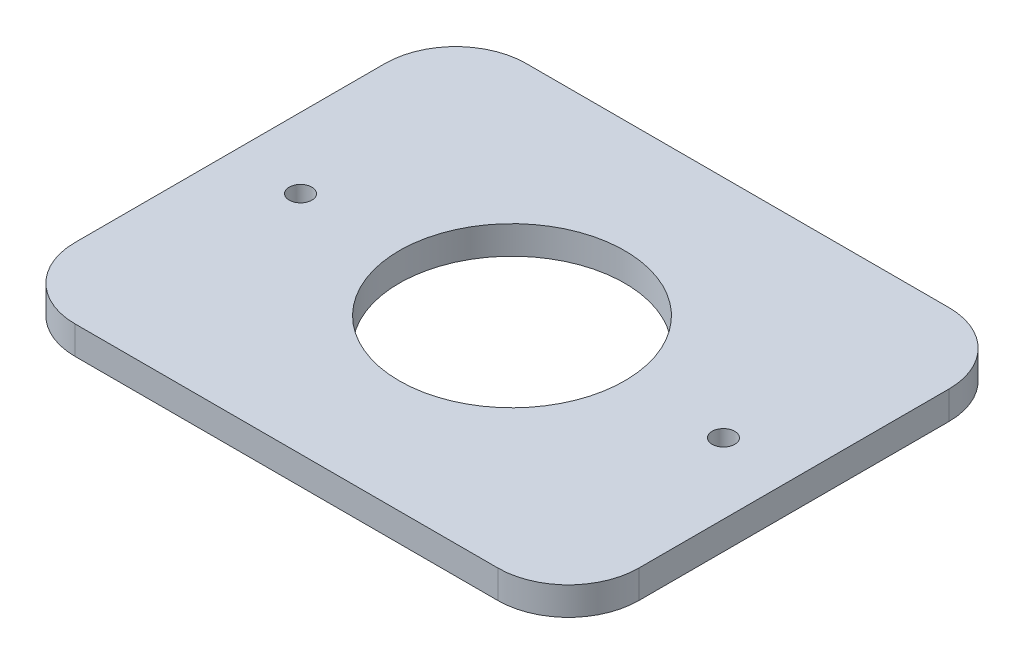
ISO-10303-21;
HEADER;
FILE_DESCRIPTION(('STEP AP214'),'2;1');
FILE_NAME('part.step','',(''),(''),'','','');
FILE_SCHEMA(('AUTOMOTIVE_DESIGN { 1 0 10303 214 1 1 1 1 }'));
ENDSEC;
DATA;
#1=APPLICATION_CONTEXT('core data for automotive mechanical design processes');
#2=APPLICATION_PROTOCOL_DEFINITION('international standard','automotive_design',2000,#1);
#3=PRODUCT_CONTEXT('',#1,'mechanical');
#4=PRODUCT('Part','Part','',(#3));
#5=PRODUCT_RELATED_PRODUCT_CATEGORY('part','',(#4));
#6=PRODUCT_DEFINITION_FORMATION('','',#4);
#7=PRODUCT_DEFINITION_CONTEXT('part definition',#1,'design');
#8=PRODUCT_DEFINITION('design','',#6,#7);
#9=PRODUCT_DEFINITION_SHAPE('','',#8);
#10=(LENGTH_UNIT() NAMED_UNIT(*) SI_UNIT(.MILLI.,.METRE.));
#11=(NAMED_UNIT(*) PLANE_ANGLE_UNIT() SI_UNIT($,.RADIAN.));
#12=(NAMED_UNIT(*) SI_UNIT($,.STERADIAN.) SOLID_ANGLE_UNIT());
#13=UNCERTAINTY_MEASURE_WITH_UNIT(LENGTH_MEASURE(1.E-05),#10,'distance_accuracy_value','');
#14=(GEOMETRIC_REPRESENTATION_CONTEXT(3) GLOBAL_UNCERTAINTY_ASSIGNED_CONTEXT((#13)) GLOBAL_UNIT_ASSIGNED_CONTEXT((#10,
#11,#12)) REPRESENTATION_CONTEXT('',''));
#15=CARTESIAN_POINT('',(0.,0.,0.));
#16=DIRECTION('',(0.,0.,1.));
#17=DIRECTION('',(1.,0.,0.));
#18=AXIS2_PLACEMENT_3D('',#15,#16,#17);
#19=CARTESIAN_POINT('',(0.,0.,0.));
#20=DIRECTION('',(0.,1.,0.));
#21=DIRECTION('',(0.,0.,1.));
#22=AXIS2_PLACEMENT_3D('',#19,#20,#21);
#23=PLANE('',#22);
#24=CARTESIAN_POINT('',(-15.,0.,0.));
#25=DIRECTION('',(0.,1.,0.));
#26=DIRECTION('',(0.,0.,1.));
#27=AXIS2_PLACEMENT_3D('',#24,#25,#26);
#28=CIRCLE('',#27,0.803797355944);
#29=CARTESIAN_POINT('',(-15.,0.,0.803797355944));
#30=VERTEX_POINT('',#29);
#31=EDGE_CURVE('E136',#30,#30,#28,.T.);
#32=ORIENTED_EDGE('',*,*,#31,.T.);
#33=EDGE_LOOP('',(#32));
#34=FACE_BOUND('',#33,.T.);
#35=CARTESIAN_POINT('',(15.,0.,0.));
#36=DIRECTION('',(0.,1.,0.));
#37=DIRECTION('',(0.,0.,1.));
#38=AXIS2_PLACEMENT_3D('',#35,#36,#37);
#39=CIRCLE('',#38,0.803797355944);
#40=CARTESIAN_POINT('',(15.,0.,0.803797355944));
#41=VERTEX_POINT('',#40);
#42=EDGE_CURVE('E139',#41,#41,#39,.T.);
#43=ORIENTED_EDGE('',*,*,#42,.T.);
#44=EDGE_LOOP('',(#43));
#45=FACE_BOUND('',#44,.T.);
#46=CARTESIAN_POINT('',(0.,0.,0.));
#47=DIRECTION('',(0.,1.,0.));
#48=DIRECTION('',(0.,0.,1.));
#49=AXIS2_PLACEMENT_3D('',#46,#47,#48);
#50=CIRCLE('',#49,8.);
#51=CARTESIAN_POINT('',(0.,0.,8.));
#52=VERTEX_POINT('',#51);
#53=EDGE_CURVE('E142',#52,#52,#50,.T.);
#54=ORIENTED_EDGE('',*,*,#53,.T.);
#55=EDGE_LOOP('',(#54));
#56=FACE_BOUND('',#55,.T.);
#57=CARTESIAN_POINT('',(-15.,0.,11.));
#58=DIRECTION('',(0.,-1.,0.));
#59=DIRECTION('',(0.,0.,-1.));
#60=AXIS2_PLACEMENT_3D('',#57,#58,#59);
#61=CIRCLE('',#60,5.);
#62=CARTESIAN_POINT('',(-20.,0.,11.));
#63=VERTEX_POINT('',#62);
#64=CARTESIAN_POINT('',(-15.,0.,16.));
#65=VERTEX_POINT('',#64);
#66=EDGE_CURVE('E148',#63,#65,#61,.F.);
#67=ORIENTED_EDGE('',*,*,#66,.F.);
#68=DIRECTION('',(0.,0.,1.));
#69=VECTOR('',#68,1.);
#70=CARTESIAN_POINT('',(-20.,0.,-16.));
#71=LINE('',#70,#69);
#72=CARTESIAN_POINT('',(-20.,0.,-11.));
#73=VERTEX_POINT('',#72);
#74=EDGE_CURVE('E114',#73,#63,#71,.T.);
#75=ORIENTED_EDGE('',*,*,#74,.F.);
#76=CARTESIAN_POINT('',(-15.,0.,-11.));
#77=DIRECTION('',(0.,-1.,0.));
#78=DIRECTION('',(0.,0.,-1.));
#79=AXIS2_PLACEMENT_3D('',#76,#77,#78);
#80=CIRCLE('',#79,5.);
#81=CARTESIAN_POINT('',(-15.,0.,-16.));
#82=VERTEX_POINT('',#81);
#83=EDGE_CURVE('E88',#82,#73,#80,.F.);
#84=ORIENTED_EDGE('',*,*,#83,.F.);
#85=DIRECTION('',(-1.,0.,0.));
#86=VECTOR('',#85,1.);
#87=CARTESIAN_POINT('',(20.,0.,-16.));
#88=LINE('',#87,#86);
#89=CARTESIAN_POINT('',(15.,0.,-16.));
#90=VERTEX_POINT('',#89);
#91=EDGE_CURVE('E83',#90,#82,#88,.T.);
#92=ORIENTED_EDGE('',*,*,#91,.F.);
#93=CARTESIAN_POINT('',(15.,0.,-11.));
#94=DIRECTION('',(0.,-1.,0.));
#95=DIRECTION('',(0.,0.,-1.));
#96=AXIS2_PLACEMENT_3D('',#93,#94,#95);
#97=CIRCLE('',#96,5.);
#98=CARTESIAN_POINT('',(20.,0.,-11.));
#99=VERTEX_POINT('',#98);
#100=EDGE_CURVE('E20',#99,#90,#97,.F.);
#101=ORIENTED_EDGE('',*,*,#100,.F.);
#102=DIRECTION('',(0.,0.,-1.));
#103=VECTOR('',#102,1.);
#104=CARTESIAN_POINT('',(20.,0.,16.));
#105=LINE('',#104,#103);
#106=CARTESIAN_POINT('',(20.,0.,11.));
#107=VERTEX_POINT('',#106);
#108=EDGE_CURVE('E78',#107,#99,#105,.T.);
#109=ORIENTED_EDGE('',*,*,#108,.F.);
#110=CARTESIAN_POINT('',(15.,0.,11.));
#111=DIRECTION('',(0.,-1.,0.));
#112=DIRECTION('',(0.,0.,-1.));
#113=AXIS2_PLACEMENT_3D('',#110,#111,#112);
#114=CIRCLE('',#113,5.);
#115=CARTESIAN_POINT('',(15.,0.,16.));
#116=VERTEX_POINT('',#115);
#117=EDGE_CURVE('E145',#116,#107,#114,.F.);
#118=ORIENTED_EDGE('',*,*,#117,.F.);
#119=DIRECTION('',(1.,0.,0.));
#120=VECTOR('',#119,1.);
#121=CARTESIAN_POINT('',(-20.,0.,16.));
#122=LINE('',#121,#120);
#123=EDGE_CURVE('E109',#65,#116,#122,.T.);
#124=ORIENTED_EDGE('',*,*,#123,.F.);
#125=EDGE_LOOP('',(#67,#75,#84,#92,#101,#109,#118,#124));
#126=FACE_BOUND('',#125,.T.);
#127=ADVANCED_FACE('F17',(#34,#45,#56,#126),#23,.F.);
#128=CARTESIAN_POINT('',(20.,0.,16.));
#129=DIRECTION('',(1.,0.,0.));
#130=DIRECTION('',(0.,0.,-1.));
#131=AXIS2_PLACEMENT_3D('',#128,#129,#130);
#132=PLANE('',#131);
#133=DIRECTION('',(0.,0.,1.));
#134=VECTOR('',#133,1.);
#135=CARTESIAN_POINT('',(20.,2.,0.));
#136=LINE('',#135,#134);
#137=CARTESIAN_POINT('',(20.,2.,11.));
#138=VERTEX_POINT('',#137);
#139=CARTESIAN_POINT('',(20.,2.,-11.));
#140=VERTEX_POINT('',#139);
#141=EDGE_CURVE('E135',#138,#140,#136,.F.);
#142=ORIENTED_EDGE('',*,*,#141,.F.);
#143=DIRECTION('',(0.,-1.,0.));
#144=VECTOR('',#143,1.);
#145=CARTESIAN_POINT('',(20.,2.015648,11.));
#146=LINE('',#145,#144);
#147=EDGE_CURVE('E111',#107,#138,#146,.F.);
#148=ORIENTED_EDGE('',*,*,#147,.F.);
#149=ORIENTED_EDGE('',*,*,#108,.T.);
#150=DIRECTION('',(0.,-1.,0.));
#151=VECTOR('',#150,1.);
#152=CARTESIAN_POINT('',(20.,2.015648,-11.));
#153=LINE('',#152,#151);
#154=EDGE_CURVE('E98',#140,#99,#153,.T.);
#155=ORIENTED_EDGE('',*,*,#154,.F.);
#156=EDGE_LOOP('',(#142,#148,#149,#155));
#157=FACE_BOUND('',#156,.T.);
#158=ADVANCED_FACE('F181',(#157),#132,.T.);
#159=CARTESIAN_POINT('',(15.,2.015648,-11.));
#160=DIRECTION('',(0.,-1.,0.));
#161=DIRECTION('',(0.,0.,-1.));
#162=AXIS2_PLACEMENT_3D('',#159,#160,#161);
#163=CYLINDRICAL_SURFACE('',#162,5.);
#164=ORIENTED_EDGE('',*,*,#154,.T.);
#165=ORIENTED_EDGE('',*,*,#100,.T.);
#166=DIRECTION('',(0.,1.,0.));
#167=VECTOR('',#166,1.);
#168=CARTESIAN_POINT('',(15.,0.,-16.));
#169=LINE('',#168,#167);
#170=CARTESIAN_POINT('',(15.,2.,-16.));
#171=VERTEX_POINT('',#170);
#172=EDGE_CURVE('E92',#171,#90,#169,.F.);
#173=ORIENTED_EDGE('',*,*,#172,.F.);
#174=CARTESIAN_POINT('',(15.,2.,-11.));
#175=DIRECTION('',(0.,-1.,0.));
#176=DIRECTION('',(0.,0.,-1.));
#177=AXIS2_PLACEMENT_3D('',#174,#175,#176);
#178=CIRCLE('',#177,5.);
#179=EDGE_CURVE('E133',#140,#171,#178,.F.);
#180=ORIENTED_EDGE('',*,*,#179,.F.);
#181=EDGE_LOOP('',(#164,#165,#173,#180));
#182=FACE_BOUND('',#181,.T.);
#183=ADVANCED_FACE('F95',(#182),#163,.T.);
#184=CARTESIAN_POINT('',(20.,0.,-16.));
#185=DIRECTION('',(0.,0.,-1.));
#186=DIRECTION('',(-1.,0.,0.));
#187=AXIS2_PLACEMENT_3D('',#184,#185,#186);
#188=PLANE('',#187);
#189=DIRECTION('',(1.,0.,0.));
#190=VECTOR('',#189,1.);
#191=CARTESIAN_POINT('',(0.,2.,-16.));
#192=LINE('',#191,#190);
#193=CARTESIAN_POINT('',(-15.,2.,-16.));
#194=VERTEX_POINT('',#193);
#195=EDGE_CURVE('E101',#171,#194,#192,.F.);
#196=ORIENTED_EDGE('',*,*,#195,.F.);
#197=ORIENTED_EDGE('',*,*,#172,.T.);
#198=ORIENTED_EDGE('',*,*,#91,.T.);
#199=DIRECTION('',(0.,-1.,0.));
#200=VECTOR('',#199,1.);
#201=CARTESIAN_POINT('',(-15.,2.015648,-16.));
#202=LINE('',#201,#200);
#203=EDGE_CURVE('E103',#194,#82,#202,.T.);
#204=ORIENTED_EDGE('',*,*,#203,.F.);
#205=EDGE_LOOP('',(#196,#197,#198,#204));
#206=FACE_BOUND('',#205,.T.);
#207=ADVANCED_FACE('F99',(#206),#188,.T.);
#208=CARTESIAN_POINT('',(-15.,2.015648,-11.));
#209=DIRECTION('',(0.,-1.,0.));
#210=DIRECTION('',(0.,0.,-1.));
#211=AXIS2_PLACEMENT_3D('',#208,#209,#210);
#212=CYLINDRICAL_SURFACE('',#211,5.);
#213=ORIENTED_EDGE('',*,*,#203,.T.);
#214=ORIENTED_EDGE('',*,*,#83,.T.);
#215=DIRECTION('',(0.,1.,0.));
#216=VECTOR('',#215,1.);
#217=CARTESIAN_POINT('',(-20.,0.,-11.));
#218=LINE('',#217,#216);
#219=CARTESIAN_POINT('',(-20.,2.,-11.));
#220=VERTEX_POINT('',#219);
#221=EDGE_CURVE('E115',#220,#73,#218,.F.);
#222=ORIENTED_EDGE('',*,*,#221,.F.);
#223=CARTESIAN_POINT('',(-15.,2.,-11.));
#224=DIRECTION('',(0.,-1.,0.));
#225=DIRECTION('',(0.,0.,-1.));
#226=AXIS2_PLACEMENT_3D('',#223,#224,#225);
#227=CIRCLE('',#226,5.);
#228=EDGE_CURVE('E130',#194,#220,#227,.F.);
#229=ORIENTED_EDGE('',*,*,#228,.F.);
#230=EDGE_LOOP('',(#213,#214,#222,#229));
#231=FACE_BOUND('',#230,.T.);
#232=ADVANCED_FACE('F152',(#231),#212,.T.);
#233=CARTESIAN_POINT('',(-20.,0.,-16.));
#234=DIRECTION('',(-1.,0.,0.));
#235=DIRECTION('',(0.,0.,1.));
#236=AXIS2_PLACEMENT_3D('',#233,#234,#235);
#237=PLANE('',#236);
#238=DIRECTION('',(0.,0.,1.));
#239=VECTOR('',#238,1.);
#240=CARTESIAN_POINT('',(-20.,2.,0.));
#241=LINE('',#240,#239);
#242=CARTESIAN_POINT('',(-20.,2.,11.));
#243=VERTEX_POINT('',#242);
#244=EDGE_CURVE('E129',#220,#243,#241,.T.);
#245=ORIENTED_EDGE('',*,*,#244,.F.);
#246=ORIENTED_EDGE('',*,*,#221,.T.);
#247=ORIENTED_EDGE('',*,*,#74,.T.);
#248=DIRECTION('',(0.,-1.,0.));
#249=VECTOR('',#248,1.);
#250=CARTESIAN_POINT('',(-20.,2.015648,11.));
#251=LINE('',#250,#249);
#252=EDGE_CURVE('E149',#243,#63,#251,.T.);
#253=ORIENTED_EDGE('',*,*,#252,.F.);
#254=EDGE_LOOP('',(#245,#246,#247,#253));
#255=FACE_BOUND('',#254,.T.);
#256=ADVANCED_FACE('F156',(#255),#237,.T.);
#257=CARTESIAN_POINT('',(-15.,2.015648,11.));
#258=DIRECTION('',(0.,-1.,0.));
#259=DIRECTION('',(0.,0.,-1.));
#260=AXIS2_PLACEMENT_3D('',#257,#258,#259);
#261=CYLINDRICAL_SURFACE('',#260,5.);
#262=ORIENTED_EDGE('',*,*,#252,.T.);
#263=ORIENTED_EDGE('',*,*,#66,.T.);
#264=DIRECTION('',(0.,1.,0.));
#265=VECTOR('',#264,1.);
#266=CARTESIAN_POINT('',(-15.,0.,16.));
#267=LINE('',#266,#265);
#268=CARTESIAN_POINT('',(-15.,2.,16.));
#269=VERTEX_POINT('',#268);
#270=EDGE_CURVE('E112',#269,#65,#267,.F.);
#271=ORIENTED_EDGE('',*,*,#270,.F.);
#272=CARTESIAN_POINT('',(-15.,2.,11.));
#273=DIRECTION('',(0.,-1.,0.));
#274=DIRECTION('',(0.,0.,-1.));
#275=AXIS2_PLACEMENT_3D('',#272,#273,#274);
#276=CIRCLE('',#275,5.);
#277=EDGE_CURVE('E126',#243,#269,#276,.F.);
#278=ORIENTED_EDGE('',*,*,#277,.F.);
#279=EDGE_LOOP('',(#262,#263,#271,#278));
#280=FACE_BOUND('',#279,.T.);
#281=ADVANCED_FACE('F178',(#280),#261,.T.);
#282=CARTESIAN_POINT('',(-20.,0.,16.));
#283=DIRECTION('',(0.,0.,1.));
#284=DIRECTION('',(1.,0.,0.));
#285=AXIS2_PLACEMENT_3D('',#282,#283,#284);
#286=PLANE('',#285);
#287=ORIENTED_EDGE('',*,*,#123,.T.);
#288=DIRECTION('',(0.,-1.,0.));
#289=VECTOR('',#288,1.);
#290=CARTESIAN_POINT('',(15.,2.015648,16.));
#291=LINE('',#290,#289);
#292=CARTESIAN_POINT('',(15.,2.,16.));
#293=VERTEX_POINT('',#292);
#294=EDGE_CURVE('E35',#293,#116,#291,.T.);
#295=ORIENTED_EDGE('',*,*,#294,.F.);
#296=DIRECTION('',(1.,0.,0.));
#297=VECTOR('',#296,1.);
#298=CARTESIAN_POINT('',(0.,2.,16.));
#299=LINE('',#298,#297);
#300=EDGE_CURVE('E125',#269,#293,#299,.T.);
#301=ORIENTED_EDGE('',*,*,#300,.F.);
#302=ORIENTED_EDGE('',*,*,#270,.T.);
#303=EDGE_LOOP('',(#287,#295,#301,#302));
#304=FACE_BOUND('',#303,.T.);
#305=ADVANCED_FACE('F174',(#304),#286,.T.);
#306=CARTESIAN_POINT('',(15.,2.015648,11.));
#307=DIRECTION('',(0.,-1.,0.));
#308=DIRECTION('',(0.,0.,-1.));
#309=AXIS2_PLACEMENT_3D('',#306,#307,#308);
#310=CYLINDRICAL_SURFACE('',#309,5.);
#311=ORIENTED_EDGE('',*,*,#294,.T.);
#312=ORIENTED_EDGE('',*,*,#117,.T.);
#313=ORIENTED_EDGE('',*,*,#147,.T.);
#314=CARTESIAN_POINT('',(15.,2.,11.));
#315=DIRECTION('',(0.,-1.,0.));
#316=DIRECTION('',(0.,0.,-1.));
#317=AXIS2_PLACEMENT_3D('',#314,#315,#316);
#318=CIRCLE('',#317,5.);
#319=EDGE_CURVE('E122',#293,#138,#318,.F.);
#320=ORIENTED_EDGE('',*,*,#319,.F.);
#321=EDGE_LOOP('',(#311,#312,#313,#320));
#322=FACE_BOUND('',#321,.T.);
#323=ADVANCED_FACE('F180',(#322),#310,.T.);
#324=CARTESIAN_POINT('',(0.,2.,0.));
#325=DIRECTION('',(0.,1.,0.));
#326=DIRECTION('',(0.,0.,1.));
#327=AXIS2_PLACEMENT_3D('',#324,#325,#326);
#328=CYLINDRICAL_SURFACE('',#327,8.);
#329=CARTESIAN_POINT('',(0.,2.,0.));
#330=DIRECTION('',(0.,1.,0.));
#331=DIRECTION('',(0.,0.,1.));
#332=AXIS2_PLACEMENT_3D('',#329,#330,#331);
#333=CIRCLE('',#332,8.);
#334=CARTESIAN_POINT('',(0.,2.,8.));
#335=VERTEX_POINT('',#334);
#336=EDGE_CURVE('E119',#335,#335,#333,.F.);
#337=ORIENTED_EDGE('',*,*,#336,.F.);
#338=EDGE_LOOP('',(#337));
#339=FACE_BOUND('',#338,.T.);
#340=ORIENTED_EDGE('',*,*,#53,.F.);
#341=EDGE_LOOP('',(#340));
#342=FACE_BOUND('',#341,.T.);
#343=ADVANCED_FACE('F204',(#339,#342),#328,.F.);
#344=CARTESIAN_POINT('',(15.,2.,0.));
#345=DIRECTION('',(0.,1.,0.));
#346=DIRECTION('',(0.,0.,1.));
#347=AXIS2_PLACEMENT_3D('',#344,#345,#346);
#348=CYLINDRICAL_SURFACE('',#347,0.803797355944);
#349=CARTESIAN_POINT('',(15.,2.,0.));
#350=DIRECTION('',(0.,1.,0.));
#351=DIRECTION('',(0.,0.,1.));
#352=AXIS2_PLACEMENT_3D('',#349,#350,#351);
#353=CIRCLE('',#352,0.803797355944);
#354=CARTESIAN_POINT('',(15.,2.,0.803797355944));
#355=VERTEX_POINT('',#354);
#356=EDGE_CURVE('E26',#355,#355,#353,.F.);
#357=ORIENTED_EDGE('',*,*,#356,.F.);
#358=EDGE_LOOP('',(#357));
#359=FACE_BOUND('',#358,.T.);
#360=ORIENTED_EDGE('',*,*,#42,.F.);
#361=EDGE_LOOP('',(#360));
#362=FACE_BOUND('',#361,.T.);
#363=ADVANCED_FACE('F197',(#359,#362),#348,.F.);
#364=CARTESIAN_POINT('',(-15.,2.,0.));
#365=DIRECTION('',(0.,1.,0.));
#366=DIRECTION('',(0.,0.,1.));
#367=AXIS2_PLACEMENT_3D('',#364,#365,#366);
#368=CYLINDRICAL_SURFACE('',#367,0.803797355944);
#369=CARTESIAN_POINT('',(-15.,2.,0.));
#370=DIRECTION('',(0.,1.,0.));
#371=DIRECTION('',(0.,0.,1.));
#372=AXIS2_PLACEMENT_3D('',#369,#370,#371);
#373=CIRCLE('',#372,0.803797355944);
#374=CARTESIAN_POINT('',(-15.,2.,0.803797355944));
#375=VERTEX_POINT('',#374);
#376=EDGE_CURVE('E11',#375,#375,#373,.F.);
#377=ORIENTED_EDGE('',*,*,#376,.F.);
#378=EDGE_LOOP('',(#377));
#379=FACE_BOUND('',#378,.T.);
#380=ORIENTED_EDGE('',*,*,#31,.F.);
#381=EDGE_LOOP('',(#380));
#382=FACE_BOUND('',#381,.T.);
#383=ADVANCED_FACE('F191',(#379,#382),#368,.F.);
#384=CARTESIAN_POINT('',(0.,2.,0.));
#385=DIRECTION('',(0.,1.,0.));
#386=DIRECTION('',(0.,0.,1.));
#387=AXIS2_PLACEMENT_3D('',#384,#385,#386);
#388=PLANE('',#387);
#389=ORIENTED_EDGE('',*,*,#376,.T.);
#390=EDGE_LOOP('',(#389));
#391=FACE_BOUND('',#390,.T.);
#392=ORIENTED_EDGE('',*,*,#356,.T.);
#393=EDGE_LOOP('',(#392));
#394=FACE_BOUND('',#393,.T.);
#395=ORIENTED_EDGE('',*,*,#336,.T.);
#396=EDGE_LOOP('',(#395));
#397=FACE_BOUND('',#396,.T.);
#398=ORIENTED_EDGE('',*,*,#300,.T.);
#399=ORIENTED_EDGE('',*,*,#319,.T.);
#400=ORIENTED_EDGE('',*,*,#141,.T.);
#401=ORIENTED_EDGE('',*,*,#179,.T.);
#402=ORIENTED_EDGE('',*,*,#195,.T.);
#403=ORIENTED_EDGE('',*,*,#228,.T.);
#404=ORIENTED_EDGE('',*,*,#244,.T.);
#405=ORIENTED_EDGE('',*,*,#277,.T.);
#406=EDGE_LOOP('',(#398,#399,#400,#401,#402,#403,#404,#405));
#407=FACE_BOUND('',#406,.T.);
#408=ADVANCED_FACE('F172',(#391,#394,#397,#407),#388,.T.);
#409=CLOSED_SHELL('',(#127,#158,#183,#207,#232,#256,#281,#305,#323,#343,#363,#383,#408));
#410=MANIFOLD_SOLID_BREP('B1',#409);
#411=ADVANCED_BREP_SHAPE_REPRESENTATION('',(#18,#410),#14);
#412=SHAPE_DEFINITION_REPRESENTATION(#9,#411);
ENDSEC;
END-ISO-10303-21;
